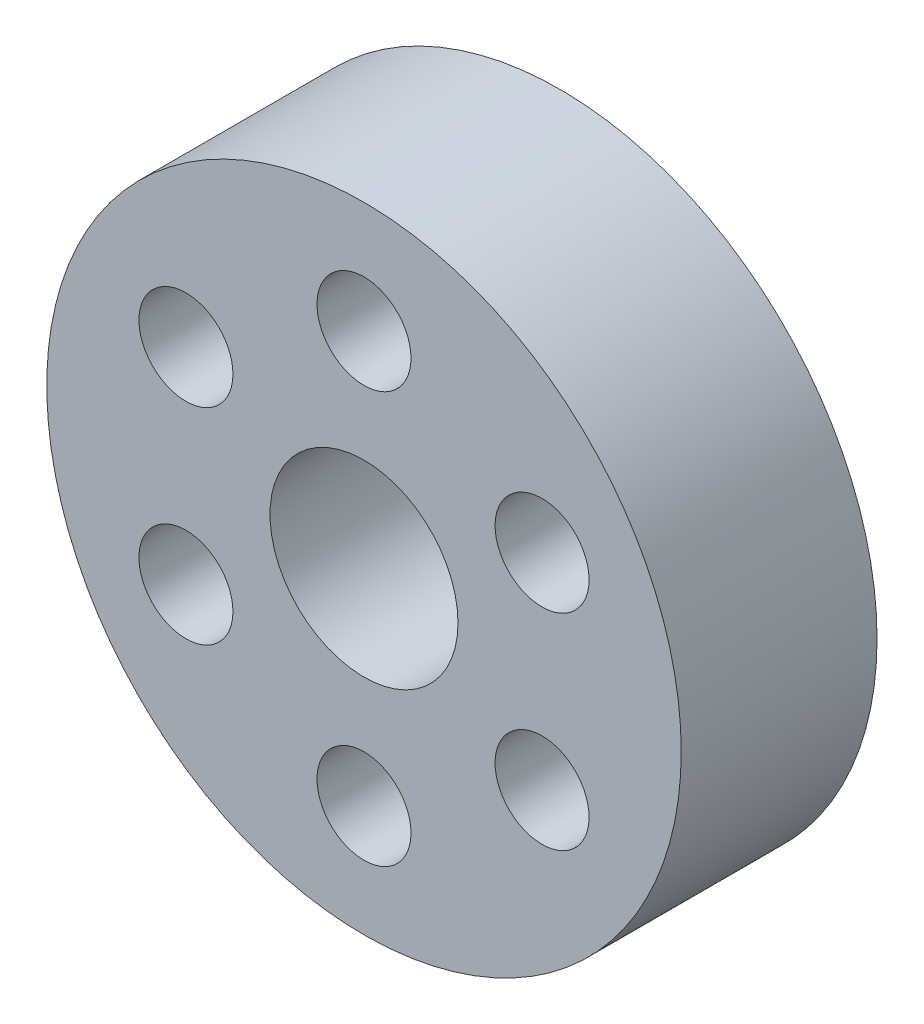
ISO-10303-21;
HEADER;
FILE_DESCRIPTION(('STEP AP214'),'2;1');
FILE_NAME('part.step','',(''),(''),'','','');
FILE_SCHEMA(('AUTOMOTIVE_DESIGN { 1 0 10303 214 1 1 1 1 }'));
ENDSEC;
DATA;
#1=APPLICATION_CONTEXT('core data for automotive mechanical design processes');
#2=APPLICATION_PROTOCOL_DEFINITION('international standard','automotive_design',2000,#1);
#3=PRODUCT_CONTEXT('',#1,'mechanical');
#4=PRODUCT('Part','Part','',(#3));
#5=PRODUCT_RELATED_PRODUCT_CATEGORY('part','',(#4));
#6=PRODUCT_DEFINITION_FORMATION('','',#4);
#7=PRODUCT_DEFINITION_CONTEXT('part definition',#1,'design');
#8=PRODUCT_DEFINITION('design','',#6,#7);
#9=PRODUCT_DEFINITION_SHAPE('','',#8);
#10=(LENGTH_UNIT() NAMED_UNIT(*) SI_UNIT(.MILLI.,.METRE.));
#11=(NAMED_UNIT(*) PLANE_ANGLE_UNIT() SI_UNIT($,.RADIAN.));
#12=(NAMED_UNIT(*) SI_UNIT($,.STERADIAN.) SOLID_ANGLE_UNIT());
#13=UNCERTAINTY_MEASURE_WITH_UNIT(LENGTH_MEASURE(1.E-05),#10,'distance_accuracy_value','');
#14=(GEOMETRIC_REPRESENTATION_CONTEXT(3) GLOBAL_UNCERTAINTY_ASSIGNED_CONTEXT((#13)) GLOBAL_UNIT_ASSIGNED_CONTEXT((#10,
#11,#12)) REPRESENTATION_CONTEXT('',''));
#15=CARTESIAN_POINT('',(0.,0.,0.));
#16=DIRECTION('',(0.,0.,1.));
#17=DIRECTION('',(1.,0.,0.));
#18=AXIS2_PLACEMENT_3D('',#15,#16,#17);
#19=CARTESIAN_POINT('',(0.,0.,3.175));
#20=DIRECTION('',(0.,0.,1.));
#21=DIRECTION('',(1.,0.,0.));
#22=AXIS2_PLACEMENT_3D('',#19,#20,#21);
#23=PLANE('',#22);
#24=CARTESIAN_POINT('',(-2.88711218986635,1.66687500000003,3.175));
#25=DIRECTION('',(0.,0.,1.));
#26=DIRECTION('',(0.50000000000001,0.866025403784433,0.));
#27=AXIS2_PLACEMENT_3D('',#24,#25,#26);
#28=CIRCLE('',#27,0.762);
#29=CARTESIAN_POINT('',(-2.50611218986635,2.32678635768377,3.175));
#30=VERTEX_POINT('',#29);
#31=EDGE_CURVE('E80',#30,#30,#28,.T.);
#32=ORIENTED_EDGE('',*,*,#31,.F.);
#33=EDGE_LOOP('',(#32));
#34=FACE_BOUND('',#33,.T.);
#35=CARTESIAN_POINT('',(-2.88711218986639,-1.66687499999997,3.175));
#36=DIRECTION('',(0.,0.,1.));
#37=DIRECTION('',(-0.499999999999992,0.866025403784443,0.));
#38=AXIS2_PLACEMENT_3D('',#35,#36,#37);
#39=CIRCLE('',#38,0.762);
#40=CARTESIAN_POINT('',(-3.26811218986638,-1.00696364231623,3.175));
#41=VERTEX_POINT('',#40);
#42=EDGE_CURVE('E74',#41,#41,#39,.T.);
#43=ORIENTED_EDGE('',*,*,#42,.F.);
#44=EDGE_LOOP('',(#43));
#45=FACE_BOUND('',#44,.T.);
#46=CARTESIAN_POINT('',(0.,-3.33375,3.175));
#47=DIRECTION('',(0.,0.,1.));
#48=DIRECTION('',(-1.,0.,0.));
#49=AXIS2_PLACEMENT_3D('',#46,#47,#48);
#50=CIRCLE('',#49,0.762);
#51=CARTESIAN_POINT('',(-0.762,-3.33375,3.175));
#52=VERTEX_POINT('',#51);
#53=EDGE_CURVE('E68',#52,#52,#50,.T.);
#54=ORIENTED_EDGE('',*,*,#53,.F.);
#55=EDGE_LOOP('',(#54));
#56=FACE_BOUND('',#55,.T.);
#57=CARTESIAN_POINT('',(2.88711218986636,-1.66687500000001,3.175));
#58=DIRECTION('',(0.,0.,1.));
#59=DIRECTION('',(-0.500000000000004,-0.866025403784436,0.));
#60=AXIS2_PLACEMENT_3D('',#57,#58,#59);
#61=CIRCLE('',#60,0.762);
#62=CARTESIAN_POINT('',(2.50611218986636,-2.32678635768375,3.175));
#63=VERTEX_POINT('',#62);
#64=EDGE_CURVE('E62',#63,#63,#61,.T.);
#65=ORIENTED_EDGE('',*,*,#64,.F.);
#66=EDGE_LOOP('',(#65));
#67=FACE_BOUND('',#66,.T.);
#68=CARTESIAN_POINT('',(2.88711218986638,1.66687499999999,3.175));
#69=DIRECTION('',(0.,0.,1.));
#70=DIRECTION('',(0.499999999999998,-0.86602540378444,0.));
#71=AXIS2_PLACEMENT_3D('',#68,#69,#70);
#72=CIRCLE('',#71,0.762);
#73=CARTESIAN_POINT('',(3.26811218986637,1.00696364231625,3.175));
#74=VERTEX_POINT('',#73);
#75=EDGE_CURVE('E56',#74,#74,#72,.T.);
#76=ORIENTED_EDGE('',*,*,#75,.F.);
#77=EDGE_LOOP('',(#76));
#78=FACE_BOUND('',#77,.T.);
#79=CARTESIAN_POINT('',(0.,3.33375,3.175));
#80=DIRECTION('',(0.,0.,1.));
#81=DIRECTION('',(1.,0.,0.));
#82=AXIS2_PLACEMENT_3D('',#79,#80,#81);
#83=CIRCLE('',#82,0.762);
#84=CARTESIAN_POINT('',(0.762,3.33375,3.175));
#85=VERTEX_POINT('',#84);
#86=EDGE_CURVE('E50',#85,#85,#83,.T.);
#87=ORIENTED_EDGE('',*,*,#86,.F.);
#88=EDGE_LOOP('',(#87));
#89=FACE_BOUND('',#88,.T.);
#90=CARTESIAN_POINT('',(0.,0.,3.175));
#91=DIRECTION('',(0.,0.,1.));
#92=DIRECTION('',(1.,0.,0.));
#93=AXIS2_PLACEMENT_3D('',#90,#91,#92);
#94=CIRCLE('',#93,5.1435);
#95=CARTESIAN_POINT('',(5.1435,0.,3.175));
#96=VERTEX_POINT('',#95);
#97=EDGE_CURVE('E10',#96,#96,#94,.T.);
#98=ORIENTED_EDGE('',*,*,#97,.T.);
#99=EDGE_LOOP('',(#98));
#100=FACE_BOUND('',#99,.T.);
#101=CARTESIAN_POINT('',(0.,0.,3.175));
#102=DIRECTION('',(0.,0.,1.));
#103=DIRECTION('',(1.,0.,0.));
#104=AXIS2_PLACEMENT_3D('',#101,#102,#103);
#105=CIRCLE('',#104,1.524);
#106=CARTESIAN_POINT('',(1.524,0.,3.175));
#107=VERTEX_POINT('',#106);
#108=EDGE_CURVE('E40',#107,#107,#105,.T.);
#109=ORIENTED_EDGE('',*,*,#108,.F.);
#110=EDGE_LOOP('',(#109));
#111=FACE_BOUND('',#110,.T.);
#112=ADVANCED_FACE('F29',(#34,#45,#56,#67,#78,#89,#100,#111),#23,.T.);
#113=CARTESIAN_POINT('',(0.,0.,0.));
#114=DIRECTION('',(0.,0.,1.));
#115=DIRECTION('',(1.,0.,0.));
#116=AXIS2_PLACEMENT_3D('',#113,#114,#115);
#117=PLANE('',#116);
#118=CARTESIAN_POINT('',(-2.88711218986635,1.66687500000003,0.));
#119=DIRECTION('',(0.,0.,1.));
#120=DIRECTION('',(1.,0.,0.));
#121=AXIS2_PLACEMENT_3D('',#118,#119,#120);
#122=CIRCLE('',#121,0.762);
#123=CARTESIAN_POINT('',(-2.12511218986635,1.66687500000003,0.));
#124=VERTEX_POINT('',#123);
#125=EDGE_CURVE('E77',#124,#124,#122,.F.);
#126=ORIENTED_EDGE('',*,*,#125,.F.);
#127=EDGE_LOOP('',(#126));
#128=FACE_BOUND('',#127,.T.);
#129=CARTESIAN_POINT('',(-2.88711218986639,-1.66687499999997,0.));
#130=DIRECTION('',(0.,0.,1.));
#131=DIRECTION('',(1.,0.,0.));
#132=AXIS2_PLACEMENT_3D('',#129,#130,#131);
#133=CIRCLE('',#132,0.762);
#134=CARTESIAN_POINT('',(-2.12511218986639,-1.66687499999997,0.));
#135=VERTEX_POINT('',#134);
#136=EDGE_CURVE('E71',#135,#135,#133,.F.);
#137=ORIENTED_EDGE('',*,*,#136,.F.);
#138=EDGE_LOOP('',(#137));
#139=FACE_BOUND('',#138,.T.);
#140=CARTESIAN_POINT('',(0.,-3.33375,0.));
#141=DIRECTION('',(0.,0.,1.));
#142=DIRECTION('',(1.,0.,0.));
#143=AXIS2_PLACEMENT_3D('',#140,#141,#142);
#144=CIRCLE('',#143,0.762);
#145=CARTESIAN_POINT('',(0.762,-3.33375,0.));
#146=VERTEX_POINT('',#145);
#147=EDGE_CURVE('E65',#146,#146,#144,.F.);
#148=ORIENTED_EDGE('',*,*,#147,.F.);
#149=EDGE_LOOP('',(#148));
#150=FACE_BOUND('',#149,.T.);
#151=CARTESIAN_POINT('',(2.88711218986636,-1.66687500000001,0.));
#152=DIRECTION('',(0.,0.,1.));
#153=DIRECTION('',(1.,0.,0.));
#154=AXIS2_PLACEMENT_3D('',#151,#152,#153);
#155=CIRCLE('',#154,0.762);
#156=CARTESIAN_POINT('',(3.64911218986636,-1.66687500000001,0.));
#157=VERTEX_POINT('',#156);
#158=EDGE_CURVE('E59',#157,#157,#155,.F.);
#159=ORIENTED_EDGE('',*,*,#158,.F.);
#160=EDGE_LOOP('',(#159));
#161=FACE_BOUND('',#160,.T.);
#162=CARTESIAN_POINT('',(2.88711218986638,1.66687499999999,0.));
#163=DIRECTION('',(0.,0.,1.));
#164=DIRECTION('',(1.,0.,0.));
#165=AXIS2_PLACEMENT_3D('',#162,#163,#164);
#166=CIRCLE('',#165,0.762);
#167=CARTESIAN_POINT('',(3.64911218986638,1.66687499999999,0.));
#168=VERTEX_POINT('',#167);
#169=EDGE_CURVE('E53',#168,#168,#166,.F.);
#170=ORIENTED_EDGE('',*,*,#169,.F.);
#171=EDGE_LOOP('',(#170));
#172=FACE_BOUND('',#171,.T.);
#173=CARTESIAN_POINT('',(0.,3.33375,0.));
#174=DIRECTION('',(0.,0.,1.));
#175=DIRECTION('',(1.,0.,0.));
#176=AXIS2_PLACEMENT_3D('',#173,#174,#175);
#177=CIRCLE('',#176,0.762);
#178=CARTESIAN_POINT('',(0.762,3.33375,0.));
#179=VERTEX_POINT('',#178);
#180=EDGE_CURVE('E45',#179,#179,#177,.F.);
#181=ORIENTED_EDGE('',*,*,#180,.F.);
#182=EDGE_LOOP('',(#181));
#183=FACE_BOUND('',#182,.T.);
#184=CARTESIAN_POINT('',(0.,0.,0.));
#185=DIRECTION('',(0.,0.,1.));
#186=DIRECTION('',(1.,0.,0.));
#187=AXIS2_PLACEMENT_3D('',#184,#185,#186);
#188=CIRCLE('',#187,5.1435);
#189=CARTESIAN_POINT('',(5.1435,0.,0.));
#190=VERTEX_POINT('',#189);
#191=EDGE_CURVE('E33',#190,#190,#188,.T.);
#192=ORIENTED_EDGE('',*,*,#191,.F.);
#193=EDGE_LOOP('',(#192));
#194=FACE_BOUND('',#193,.T.);
#195=CARTESIAN_POINT('',(0.,0.,0.));
#196=DIRECTION('',(0.,0.,1.));
#197=DIRECTION('',(1.,0.,0.));
#198=AXIS2_PLACEMENT_3D('',#195,#196,#197);
#199=CIRCLE('',#198,1.524);
#200=CARTESIAN_POINT('',(1.524,0.,0.));
#201=VERTEX_POINT('',#200);
#202=EDGE_CURVE('E42',#201,#201,#199,.T.);
#203=ORIENTED_EDGE('',*,*,#202,.T.);
#204=EDGE_LOOP('',(#203));
#205=FACE_BOUND('',#204,.T.);
#206=ADVANCED_FACE('F89',(#128,#139,#150,#161,#172,#183,#194,#205),#117,.F.);
#207=CARTESIAN_POINT('',(0.,0.,3.175));
#208=DIRECTION('',(0.,0.,-1.));
#209=DIRECTION('',(-1.,0.,0.));
#210=AXIS2_PLACEMENT_3D('',#207,#208,#209);
#211=CYLINDRICAL_SURFACE('',#210,5.1435);
#212=ORIENTED_EDGE('',*,*,#97,.F.);
#213=EDGE_LOOP('',(#212));
#214=FACE_BOUND('',#213,.T.);
#215=ORIENTED_EDGE('',*,*,#191,.T.);
#216=EDGE_LOOP('',(#215));
#217=FACE_BOUND('',#216,.T.);
#218=ADVANCED_FACE('F31',(#214,#217),#211,.T.);
#219=CARTESIAN_POINT('',(0.,0.,3.175));
#220=DIRECTION('',(0.,0.,-1.));
#221=DIRECTION('',(-1.,0.,0.));
#222=AXIS2_PLACEMENT_3D('',#219,#220,#221);
#223=CYLINDRICAL_SURFACE('',#222,1.524);
#224=ORIENTED_EDGE('',*,*,#108,.T.);
#225=EDGE_LOOP('',(#224));
#226=FACE_BOUND('',#225,.T.);
#227=ORIENTED_EDGE('',*,*,#202,.F.);
#228=EDGE_LOOP('',(#227));
#229=FACE_BOUND('',#228,.T.);
#230=ADVANCED_FACE('F103',(#226,#229),#223,.F.);
#231=CARTESIAN_POINT('',(0.,3.33375,-0.00100000000000013));
#232=DIRECTION('',(0.,0.,1.));
#233=DIRECTION('',(1.,0.,0.));
#234=AXIS2_PLACEMENT_3D('',#231,#232,#233);
#235=CYLINDRICAL_SURFACE('',#234,0.762);
#236=ORIENTED_EDGE('',*,*,#86,.T.);
#237=EDGE_LOOP('',(#236));
#238=FACE_BOUND('',#237,.T.);
#239=ORIENTED_EDGE('',*,*,#180,.T.);
#240=EDGE_LOOP('',(#239));
#241=FACE_BOUND('',#240,.T.);
#242=ADVANCED_FACE('F106',(#238,#241),#235,.F.);
#243=CARTESIAN_POINT('',(2.88711218986638,1.66687499999999,-0.00100000000000013));
#244=DIRECTION('',(0.,0.,1.));
#245=DIRECTION('',(1.,0.,0.));
#246=AXIS2_PLACEMENT_3D('',#243,#244,#245);
#247=CYLINDRICAL_SURFACE('',#246,0.762);
#248=ORIENTED_EDGE('',*,*,#75,.T.);
#249=EDGE_LOOP('',(#248));
#250=FACE_BOUND('',#249,.T.);
#251=ORIENTED_EDGE('',*,*,#169,.T.);
#252=EDGE_LOOP('',(#251));
#253=FACE_BOUND('',#252,.T.);
#254=ADVANCED_FACE('F122',(#250,#253),#247,.F.);
#255=CARTESIAN_POINT('',(2.88711218986636,-1.66687500000001,-0.00100000000000013));
#256=DIRECTION('',(0.,0.,1.));
#257=DIRECTION('',(1.,0.,0.));
#258=AXIS2_PLACEMENT_3D('',#255,#256,#257);
#259=CYLINDRICAL_SURFACE('',#258,0.762);
#260=ORIENTED_EDGE('',*,*,#64,.T.);
#261=EDGE_LOOP('',(#260));
#262=FACE_BOUND('',#261,.T.);
#263=ORIENTED_EDGE('',*,*,#158,.T.);
#264=EDGE_LOOP('',(#263));
#265=FACE_BOUND('',#264,.T.);
#266=ADVANCED_FACE('F126',(#262,#265),#259,.F.);
#267=CARTESIAN_POINT('',(0.,-3.33375,-0.00100000000000013));
#268=DIRECTION('',(0.,0.,1.));
#269=DIRECTION('',(1.,0.,0.));
#270=AXIS2_PLACEMENT_3D('',#267,#268,#269);
#271=CYLINDRICAL_SURFACE('',#270,0.762);
#272=ORIENTED_EDGE('',*,*,#53,.T.);
#273=EDGE_LOOP('',(#272));
#274=FACE_BOUND('',#273,.T.);
#275=ORIENTED_EDGE('',*,*,#147,.T.);
#276=EDGE_LOOP('',(#275));
#277=FACE_BOUND('',#276,.T.);
#278=ADVANCED_FACE('F130',(#274,#277),#271,.F.);
#279=CARTESIAN_POINT('',(-2.88711218986639,-1.66687499999997,-0.00100000000000013));
#280=DIRECTION('',(0.,0.,1.));
#281=DIRECTION('',(1.,0.,0.));
#282=AXIS2_PLACEMENT_3D('',#279,#280,#281);
#283=CYLINDRICAL_SURFACE('',#282,0.762);
#284=ORIENTED_EDGE('',*,*,#42,.T.);
#285=EDGE_LOOP('',(#284));
#286=FACE_BOUND('',#285,.T.);
#287=ORIENTED_EDGE('',*,*,#136,.T.);
#288=EDGE_LOOP('',(#287));
#289=FACE_BOUND('',#288,.T.);
#290=ADVANCED_FACE('F134',(#286,#289),#283,.F.);
#291=CARTESIAN_POINT('',(-2.88711218986635,1.66687500000003,-0.00100000000000013));
#292=DIRECTION('',(0.,0.,1.));
#293=DIRECTION('',(1.,0.,0.));
#294=AXIS2_PLACEMENT_3D('',#291,#292,#293);
#295=CYLINDRICAL_SURFACE('',#294,0.762);
#296=ORIENTED_EDGE('',*,*,#31,.T.);
#297=EDGE_LOOP('',(#296));
#298=FACE_BOUND('',#297,.T.);
#299=ORIENTED_EDGE('',*,*,#125,.T.);
#300=EDGE_LOOP('',(#299));
#301=FACE_BOUND('',#300,.T.);
#302=ADVANCED_FACE('F84',(#298,#301),#295,.F.);
#303=CLOSED_SHELL('',(#112,#206,#218,#230,#242,#254,#266,#278,#290,#302));
#304=MANIFOLD_SOLID_BREP('B2',#303);
#305=ADVANCED_BREP_SHAPE_REPRESENTATION('',(#18,#304),#14);
#306=SHAPE_DEFINITION_REPRESENTATION(#9,#305);
ENDSEC;
END-ISO-10303-21;
